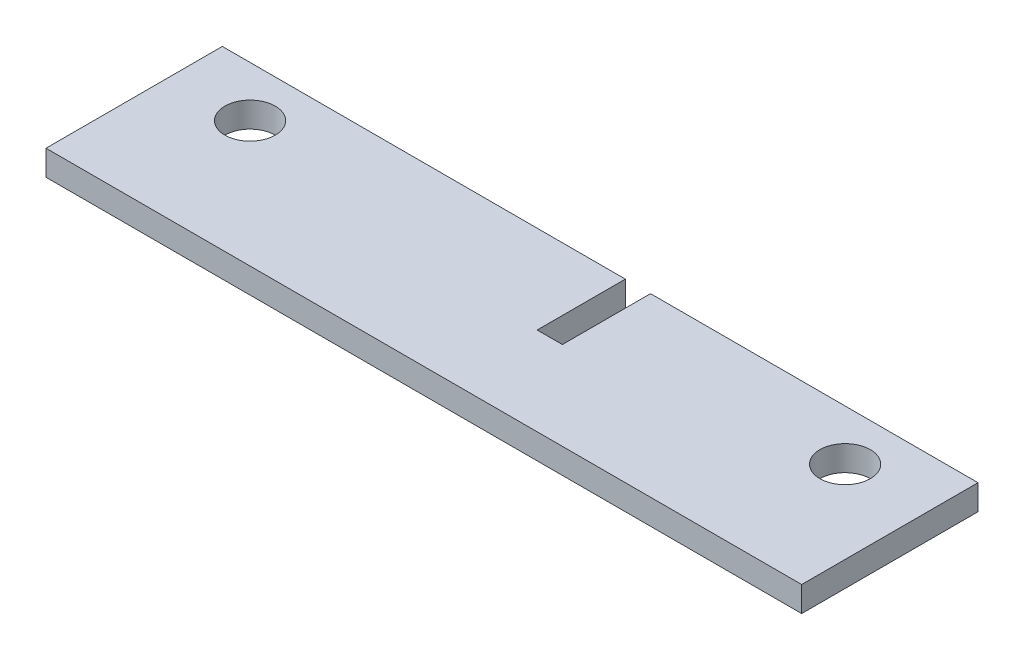
ISO-10303-21;
HEADER;
FILE_DESCRIPTION(('STEP AP214'),'2;1');
FILE_NAME('part.step','',(''),(''),'','','');
FILE_SCHEMA(('AUTOMOTIVE_DESIGN { 1 0 10303 214 1 1 1 1 }'));
ENDSEC;
DATA;
#1=APPLICATION_CONTEXT('core data for automotive mechanical design processes');
#2=APPLICATION_PROTOCOL_DEFINITION('international standard','automotive_design',2000,#1);
#3=PRODUCT_CONTEXT('',#1,'mechanical');
#4=PRODUCT('Part','Part','',(#3));
#5=PRODUCT_RELATED_PRODUCT_CATEGORY('part','',(#4));
#6=PRODUCT_DEFINITION_FORMATION('','',#4);
#7=PRODUCT_DEFINITION_CONTEXT('part definition',#1,'design');
#8=PRODUCT_DEFINITION('design','',#6,#7);
#9=PRODUCT_DEFINITION_SHAPE('','',#8);
#10=(LENGTH_UNIT() NAMED_UNIT(*) SI_UNIT(.MILLI.,.METRE.));
#11=(NAMED_UNIT(*) PLANE_ANGLE_UNIT() SI_UNIT($,.RADIAN.));
#12=(NAMED_UNIT(*) SI_UNIT($,.STERADIAN.) SOLID_ANGLE_UNIT());
#13=UNCERTAINTY_MEASURE_WITH_UNIT(LENGTH_MEASURE(1.E-05),#10,'distance_accuracy_value','');
#14=(GEOMETRIC_REPRESENTATION_CONTEXT(3) GLOBAL_UNCERTAINTY_ASSIGNED_CONTEXT((#13)) GLOBAL_UNIT_ASSIGNED_CONTEXT((#10,
#11,#12)) REPRESENTATION_CONTEXT('',''));
#15=CARTESIAN_POINT('',(0.,0.,0.));
#16=DIRECTION('',(0.,0.,1.));
#17=DIRECTION('',(1.,0.,0.));
#18=AXIS2_PLACEMENT_3D('',#15,#16,#17);
#19=CARTESIAN_POINT('',(0.,0.,249.6));
#20=DIRECTION('',(0.,0.,-1.));
#21=DIRECTION('',(-1.,0.,0.));
#22=AXIS2_PLACEMENT_3D('',#19,#20,#21);
#23=PLANE('',#22);
#24=DIRECTION('',(0.,1.,0.));
#25=VECTOR('',#24,1.);
#26=CARTESIAN_POINT('',(2476.5,115.8,249.6));
#27=LINE('',#26,#25);
#28=CARTESIAN_POINT('',(2476.5,115.8,249.6));
#29=VERTEX_POINT('',#28);
#30=CARTESIAN_POINT('',(2476.5,128.5,249.6));
#31=VERTEX_POINT('',#30);
#32=EDGE_CURVE('E130',#29,#31,#27,.T.);
#33=ORIENTED_EDGE('',*,*,#32,.T.);
#34=DIRECTION('',(-1.,0.,0.));
#35=VECTOR('',#34,1.);
#36=CARTESIAN_POINT('',(2260.6,128.5,249.6));
#37=LINE('',#36,#35);
#38=CARTESIAN_POINT('',(2641.6,128.5,249.6));
#39=VERTEX_POINT('',#38);
#40=EDGE_CURVE('E113',#39,#31,#37,.T.);
#41=ORIENTED_EDGE('',*,*,#40,.F.);
#42=DIRECTION('',(0.,1.,0.));
#43=VECTOR('',#42,1.);
#44=CARTESIAN_POINT('',(2641.6,115.8,249.6));
#45=LINE('',#44,#43);
#46=CARTESIAN_POINT('',(2641.6,115.8,249.6));
#47=VERTEX_POINT('',#46);
#48=EDGE_CURVE('E177',#47,#39,#45,.T.);
#49=ORIENTED_EDGE('',*,*,#48,.F.);
#50=DIRECTION('',(1.,0.,0.));
#51=VECTOR('',#50,1.);
#52=CARTESIAN_POINT('',(2260.6,115.8,249.6));
#53=LINE('',#52,#51);
#54=EDGE_CURVE('E158',#29,#47,#53,.T.);
#55=ORIENTED_EDGE('',*,*,#54,.F.);
#56=EDGE_LOOP('',(#33,#41,#49,#55));
#57=FACE_BOUND('',#56,.T.);
#58=ADVANCED_FACE('F37',(#57),#23,.T.);
#59=CARTESIAN_POINT('',(2260.6,115.8,249.6));
#60=DIRECTION('',(-1.,0.,0.));
#61=DIRECTION('',(0.,0.,1.));
#62=AXIS2_PLACEMENT_3D('',#59,#60,#61);
#63=PLANE('',#62);
#64=DIRECTION('',(0.,0.,1.));
#65=VECTOR('',#64,1.);
#66=CARTESIAN_POINT('',(2260.6,115.8,249.6));
#67=LINE('',#66,#65);
#68=CARTESIAN_POINT('',(2260.6,115.8,249.6));
#69=VERTEX_POINT('',#68);
#70=CARTESIAN_POINT('',(2260.6,115.8,338.5));
#71=VERTEX_POINT('',#70);
#72=EDGE_CURVE('E127',#69,#71,#67,.T.);
#73=ORIENTED_EDGE('',*,*,#72,.T.);
#74=DIRECTION('',(0.,-1.,0.));
#75=VECTOR('',#74,1.);
#76=CARTESIAN_POINT('',(2260.6,115.8,338.5));
#77=LINE('',#76,#75);
#78=CARTESIAN_POINT('',(2260.6,128.5,338.5));
#79=VERTEX_POINT('',#78);
#80=EDGE_CURVE('E120',#79,#71,#77,.T.);
#81=ORIENTED_EDGE('',*,*,#80,.F.);
#82=DIRECTION('',(0.,0.,1.));
#83=VECTOR('',#82,1.);
#84=CARTESIAN_POINT('',(2260.6,128.5,249.6));
#85=LINE('',#84,#83);
#86=CARTESIAN_POINT('',(2260.6,128.5,249.6));
#87=VERTEX_POINT('',#86);
#88=EDGE_CURVE('E107',#87,#79,#85,.T.);
#89=ORIENTED_EDGE('',*,*,#88,.F.);
#90=DIRECTION('',(0.,-1.,0.));
#91=VECTOR('',#90,1.);
#92=CARTESIAN_POINT('',(2260.6,115.8,249.6));
#93=LINE('',#92,#91);
#94=EDGE_CURVE('E118',#87,#69,#93,.T.);
#95=ORIENTED_EDGE('',*,*,#94,.T.);
#96=EDGE_LOOP('',(#73,#81,#89,#95));
#97=FACE_BOUND('',#96,.T.);
#98=ADVANCED_FACE('F117',(#97),#63,.T.);
#99=CARTESIAN_POINT('',(2260.6,128.5,249.6));
#100=DIRECTION('',(0.,1.,0.));
#101=DIRECTION('',(0.,0.,1.));
#102=AXIS2_PLACEMENT_3D('',#99,#100,#101);
#103=PLANE('',#102);
#104=CARTESIAN_POINT('',(2599.99999999996,128.5,275.));
#105=DIRECTION('',(0.,1.,0.));
#106=DIRECTION('',(0.,0.,1.));
#107=AXIS2_PLACEMENT_3D('',#104,#105,#106);
#108=CIRCLE('',#107,12.6999999999999);
#109=CARTESIAN_POINT('',(2599.99999999996,128.5,262.3));
#110=VERTEX_POINT('',#109);
#111=EDGE_CURVE('E126',#110,#110,#108,.F.);
#112=ORIENTED_EDGE('',*,*,#111,.T.);
#113=EDGE_LOOP('',(#112));
#114=FACE_BOUND('',#113,.T.);
#115=CARTESIAN_POINT('',(2299.99999999996,128.5,275.));
#116=DIRECTION('',(0.,1.,0.));
#117=DIRECTION('',(0.,0.,1.));
#118=AXIS2_PLACEMENT_3D('',#115,#116,#117);
#119=CIRCLE('',#118,12.6999999999999);
#120=CARTESIAN_POINT('',(2299.99999999996,128.5,262.3));
#121=VERTEX_POINT('',#120);
#122=EDGE_CURVE('E41',#121,#121,#119,.F.);
#123=ORIENTED_EDGE('',*,*,#122,.T.);
#124=EDGE_LOOP('',(#123));
#125=FACE_BOUND('',#124,.T.);
#126=DIRECTION('',(0.,0.,-1.));
#127=VECTOR('',#126,1.);
#128=CARTESIAN_POINT('',(2476.5,128.5,249.6));
#129=LINE('',#128,#127);
#130=CARTESIAN_POINT('',(2476.5,128.5,294.05));
#131=VERTEX_POINT('',#130);
#132=EDGE_CURVE('E137',#131,#31,#129,.T.);
#133=ORIENTED_EDGE('',*,*,#132,.F.);
#134=DIRECTION('',(1.,0.,0.));
#135=VECTOR('',#134,1.);
#136=CARTESIAN_POINT('',(2476.5,128.5,294.05));
#137=LINE('',#136,#135);
#138=CARTESIAN_POINT('',(2463.8,128.5,294.05));
#139=VERTEX_POINT('',#138);
#140=EDGE_CURVE('E148',#139,#131,#137,.T.);
#141=ORIENTED_EDGE('',*,*,#140,.F.);
#142=DIRECTION('',(0.,0.,1.));
#143=VECTOR('',#142,1.);
#144=CARTESIAN_POINT('',(2463.8,128.5,294.05));
#145=LINE('',#144,#143);
#146=CARTESIAN_POINT('',(2463.8,128.5,249.6));
#147=VERTEX_POINT('',#146);
#148=EDGE_CURVE('E47',#147,#139,#145,.T.);
#149=ORIENTED_EDGE('',*,*,#148,.F.);
#150=EDGE_CURVE('E103',#147,#87,#37,.T.);
#151=ORIENTED_EDGE('',*,*,#150,.T.);
#152=ORIENTED_EDGE('',*,*,#88,.T.);
#153=DIRECTION('',(-1.,0.,0.));
#154=VECTOR('',#153,1.);
#155=CARTESIAN_POINT('',(2260.6,128.5,338.5));
#156=LINE('',#155,#154);
#157=CARTESIAN_POINT('',(2641.6,128.5,338.5));
#158=VERTEX_POINT('',#157);
#159=EDGE_CURVE('E135',#158,#79,#156,.T.);
#160=ORIENTED_EDGE('',*,*,#159,.F.);
#161=DIRECTION('',(0.,0.,1.));
#162=VECTOR('',#161,1.);
#163=CARTESIAN_POINT('',(2641.6,128.5,249.6));
#164=LINE('',#163,#162);
#165=EDGE_CURVE('E181',#39,#158,#164,.T.);
#166=ORIENTED_EDGE('',*,*,#165,.F.);
#167=ORIENTED_EDGE('',*,*,#40,.T.);
#168=EDGE_LOOP('',(#133,#141,#149,#151,#152,#160,#166,#167));
#169=FACE_BOUND('',#168,.T.);
#170=ADVANCED_FACE('F39',(#114,#125,#169),#103,.T.);
#171=CARTESIAN_POINT('',(2641.6,115.8,249.6));
#172=DIRECTION('',(1.,0.,0.));
#173=DIRECTION('',(0.,0.,-1.));
#174=AXIS2_PLACEMENT_3D('',#171,#172,#173);
#175=PLANE('',#174);
#176=ORIENTED_EDGE('',*,*,#165,.T.);
#177=DIRECTION('',(0.,1.,0.));
#178=VECTOR('',#177,1.);
#179=CARTESIAN_POINT('',(2641.6,115.8,338.5));
#180=LINE('',#179,#178);
#181=CARTESIAN_POINT('',(2641.6,115.8,338.5));
#182=VERTEX_POINT('',#181);
#183=EDGE_CURVE('E138',#182,#158,#180,.T.);
#184=ORIENTED_EDGE('',*,*,#183,.F.);
#185=DIRECTION('',(0.,0.,1.));
#186=VECTOR('',#185,1.);
#187=CARTESIAN_POINT('',(2641.6,115.8,249.6));
#188=LINE('',#187,#186);
#189=EDGE_CURVE('E165',#47,#182,#188,.T.);
#190=ORIENTED_EDGE('',*,*,#189,.F.);
#191=ORIENTED_EDGE('',*,*,#48,.T.);
#192=EDGE_LOOP('',(#176,#184,#190,#191));
#193=FACE_BOUND('',#192,.T.);
#194=ADVANCED_FACE('F176',(#193),#175,.T.);
#195=CARTESIAN_POINT('',(2260.6,115.8,249.6));
#196=DIRECTION('',(0.,-1.,0.));
#197=DIRECTION('',(0.,0.,-1.));
#198=AXIS2_PLACEMENT_3D('',#195,#196,#197);
#199=PLANE('',#198);
#200=CARTESIAN_POINT('',(2599.99999999996,115.8,275.));
#201=DIRECTION('',(0.,-1.,0.));
#202=DIRECTION('',(0.,0.,-1.));
#203=AXIS2_PLACEMENT_3D('',#200,#201,#202);
#204=CIRCLE('',#203,12.6999999999999);
#205=CARTESIAN_POINT('',(2599.99999999996,115.8,262.3));
#206=VERTEX_POINT('',#205);
#207=EDGE_CURVE('E180',#206,#206,#204,.F.);
#208=ORIENTED_EDGE('',*,*,#207,.T.);
#209=EDGE_LOOP('',(#208));
#210=FACE_BOUND('',#209,.T.);
#211=CARTESIAN_POINT('',(2299.99999999996,115.8,275.));
#212=DIRECTION('',(0.,-1.,0.));
#213=DIRECTION('',(0.,0.,-1.));
#214=AXIS2_PLACEMENT_3D('',#211,#212,#213);
#215=CIRCLE('',#214,12.6999999999999);
#216=CARTESIAN_POINT('',(2299.99999999996,115.8,262.3));
#217=VERTEX_POINT('',#216);
#218=EDGE_CURVE('E159',#217,#217,#215,.F.);
#219=ORIENTED_EDGE('',*,*,#218,.T.);
#220=EDGE_LOOP('',(#219));
#221=FACE_BOUND('',#220,.T.);
#222=DIRECTION('',(0.,0.,-1.));
#223=VECTOR('',#222,1.);
#224=CARTESIAN_POINT('',(2476.5,115.8,249.6));
#225=LINE('',#224,#223);
#226=CARTESIAN_POINT('',(2476.5,115.8,294.05));
#227=VERTEX_POINT('',#226);
#228=EDGE_CURVE('E155',#227,#29,#225,.T.);
#229=ORIENTED_EDGE('',*,*,#228,.T.);
#230=ORIENTED_EDGE('',*,*,#54,.T.);
#231=ORIENTED_EDGE('',*,*,#189,.T.);
#232=DIRECTION('',(1.,0.,0.));
#233=VECTOR('',#232,1.);
#234=CARTESIAN_POINT('',(2260.6,115.8,338.5));
#235=LINE('',#234,#233);
#236=EDGE_CURVE('E141',#71,#182,#235,.T.);
#237=ORIENTED_EDGE('',*,*,#236,.F.);
#238=ORIENTED_EDGE('',*,*,#72,.F.);
#239=CARTESIAN_POINT('',(2463.8,115.8,249.6));
#240=VERTEX_POINT('',#239);
#241=EDGE_CURVE('E125',#69,#240,#53,.T.);
#242=ORIENTED_EDGE('',*,*,#241,.T.);
#243=DIRECTION('',(0.,0.,1.));
#244=VECTOR('',#243,1.);
#245=CARTESIAN_POINT('',(2463.8,115.8,294.05));
#246=LINE('',#245,#244);
#247=CARTESIAN_POINT('',(2463.8,115.8,294.05));
#248=VERTEX_POINT('',#247);
#249=EDGE_CURVE('E162',#240,#248,#246,.T.);
#250=ORIENTED_EDGE('',*,*,#249,.T.);
#251=DIRECTION('',(1.,0.,0.));
#252=VECTOR('',#251,1.);
#253=CARTESIAN_POINT('',(2476.5,115.8,294.05));
#254=LINE('',#253,#252);
#255=EDGE_CURVE('E144',#248,#227,#254,.T.);
#256=ORIENTED_EDGE('',*,*,#255,.T.);
#257=EDGE_LOOP('',(#229,#230,#231,#237,#238,#242,#250,#256));
#258=FACE_BOUND('',#257,.T.);
#259=ADVANCED_FACE('F169',(#210,#221,#258),#199,.T.);
#260=DIRECTION('',(0.,1.,0.));
#261=VECTOR('',#260,1.);
#262=CARTESIAN_POINT('',(2463.8,115.8,249.6));
#263=LINE('',#262,#261);
#264=EDGE_CURVE('E11',#240,#147,#263,.T.);
#265=ORIENTED_EDGE('',*,*,#264,.F.);
#266=ORIENTED_EDGE('',*,*,#241,.F.);
#267=ORIENTED_EDGE('',*,*,#94,.F.);
#268=ORIENTED_EDGE('',*,*,#150,.F.);
#269=EDGE_LOOP('',(#265,#266,#267,#268));
#270=FACE_BOUND('',#269,.T.);
#271=ADVANCED_FACE('F123',(#270),#23,.T.);
#272=CARTESIAN_POINT('',(0.,0.,338.5));
#273=DIRECTION('',(0.,0.,-1.));
#274=DIRECTION('',(-1.,0.,0.));
#275=AXIS2_PLACEMENT_3D('',#272,#273,#274);
#276=PLANE('',#275);
#277=ORIENTED_EDGE('',*,*,#80,.T.);
#278=ORIENTED_EDGE('',*,*,#236,.T.);
#279=ORIENTED_EDGE('',*,*,#183,.T.);
#280=ORIENTED_EDGE('',*,*,#159,.T.);
#281=EDGE_LOOP('',(#277,#278,#279,#280));
#282=FACE_BOUND('',#281,.T.);
#283=ADVANCED_FACE('F214',(#282),#276,.F.);
#284=CARTESIAN_POINT('',(2476.5,115.8,249.6));
#285=DIRECTION('',(1.,0.,0.));
#286=DIRECTION('',(0.,0.,-1.));
#287=AXIS2_PLACEMENT_3D('',#284,#285,#286);
#288=PLANE('',#287);
#289=ORIENTED_EDGE('',*,*,#132,.T.);
#290=ORIENTED_EDGE('',*,*,#32,.F.);
#291=ORIENTED_EDGE('',*,*,#228,.F.);
#292=DIRECTION('',(0.,1.,0.));
#293=VECTOR('',#292,1.);
#294=CARTESIAN_POINT('',(2476.5,115.8,294.05));
#295=LINE('',#294,#293);
#296=EDGE_CURVE('E71',#227,#131,#295,.T.);
#297=ORIENTED_EDGE('',*,*,#296,.T.);
#298=EDGE_LOOP('',(#289,#290,#291,#297));
#299=FACE_BOUND('',#298,.T.);
#300=ADVANCED_FACE('F219',(#299),#288,.F.);
#301=CARTESIAN_POINT('',(2476.5,115.8,294.05));
#302=DIRECTION('',(0.,0.,1.));
#303=DIRECTION('',(1.,0.,0.));
#304=AXIS2_PLACEMENT_3D('',#301,#302,#303);
#305=PLANE('',#304);
#306=ORIENTED_EDGE('',*,*,#140,.T.);
#307=ORIENTED_EDGE('',*,*,#296,.F.);
#308=ORIENTED_EDGE('',*,*,#255,.F.);
#309=DIRECTION('',(0.,1.,0.));
#310=VECTOR('',#309,1.);
#311=CARTESIAN_POINT('',(2463.8,115.8,294.05));
#312=LINE('',#311,#310);
#313=EDGE_CURVE('E146',#248,#139,#312,.T.);
#314=ORIENTED_EDGE('',*,*,#313,.T.);
#315=EDGE_LOOP('',(#306,#307,#308,#314));
#316=FACE_BOUND('',#315,.T.);
#317=ADVANCED_FACE('F202',(#316),#305,.F.);
#318=CARTESIAN_POINT('',(2463.8,115.8,294.05));
#319=DIRECTION('',(-1.,0.,0.));
#320=DIRECTION('',(0.,0.,1.));
#321=AXIS2_PLACEMENT_3D('',#318,#319,#320);
#322=PLANE('',#321);
#323=ORIENTED_EDGE('',*,*,#148,.T.);
#324=ORIENTED_EDGE('',*,*,#313,.F.);
#325=ORIENTED_EDGE('',*,*,#249,.F.);
#326=ORIENTED_EDGE('',*,*,#264,.T.);
#327=EDGE_LOOP('',(#323,#324,#325,#326));
#328=FACE_BOUND('',#327,.T.);
#329=ADVANCED_FACE('F193',(#328),#322,.F.);
#330=CARTESIAN_POINT('',(2299.99999999996,181.249999999996,275.));
#331=DIRECTION('',(0.,-1.,0.));
#332=DIRECTION('',(0.,0.,-1.));
#333=AXIS2_PLACEMENT_3D('',#330,#331,#332);
#334=CYLINDRICAL_SURFACE('',#333,12.6999999999999);
#335=CARTESIAN_POINT('',(2299.99999999996,128.5,262.3));
#336=CARTESIAN_POINT('',(2299.99999999996,128.367708333333,262.3));
#337=CARTESIAN_POINT('',(2299.99999999996,128.235416666667,262.3));
#338=CARTESIAN_POINT('',(2299.99999999996,127.970833333333,262.3));
#339=CARTESIAN_POINT('',(2299.99999999996,127.838541666667,262.3));
#340=CARTESIAN_POINT('',(2299.99999999996,127.573958333333,262.3));
#341=CARTESIAN_POINT('',(2299.99999999996,127.441666666667,262.3));
#342=CARTESIAN_POINT('',(2299.99999999996,127.177083333333,262.3));
#343=CARTESIAN_POINT('',(2299.99999999996,127.044791666667,262.3));
#344=CARTESIAN_POINT('',(2299.99999999996,126.780208333333,262.3));
#345=CARTESIAN_POINT('',(2299.99999999996,126.647916666667,262.3));
#346=CARTESIAN_POINT('',(2299.99999999996,126.383333333333,262.3));
#347=CARTESIAN_POINT('',(2299.99999999996,126.251041666667,262.3));
#348=CARTESIAN_POINT('',(2299.99999999996,125.986458333333,262.3));
#349=CARTESIAN_POINT('',(2299.99999999996,125.854166666667,262.3));
#350=CARTESIAN_POINT('',(2299.99999999996,125.589583333333,262.3));
#351=CARTESIAN_POINT('',(2299.99999999996,125.457291666667,262.3));
#352=CARTESIAN_POINT('',(2299.99999999996,125.192708333333,262.3));
#353=CARTESIAN_POINT('',(2299.99999999996,125.060416666667,262.3));
#354=CARTESIAN_POINT('',(2299.99999999996,124.795833333333,262.3));
#355=CARTESIAN_POINT('',(2299.99999999996,124.663541666667,262.3));
#356=CARTESIAN_POINT('',(2299.99999999996,124.398958333333,262.3));
#357=CARTESIAN_POINT('',(2299.99999999996,124.266666666667,262.3));
#358=CARTESIAN_POINT('',(2299.99999999996,124.002083333333,262.3));
#359=CARTESIAN_POINT('',(2299.99999999996,123.869791666667,262.3));
#360=CARTESIAN_POINT('',(2299.99999999996,123.605208333333,262.3));
#361=CARTESIAN_POINT('',(2299.99999999996,123.472916666667,262.3));
#362=CARTESIAN_POINT('',(2299.99999999996,123.208333333333,262.3));
#363=CARTESIAN_POINT('',(2299.99999999996,123.076041666667,262.3));
#364=CARTESIAN_POINT('',(2299.99999999996,122.811458333333,262.3));
#365=CARTESIAN_POINT('',(2299.99999999996,122.679166666667,262.3));
#366=CARTESIAN_POINT('',(2299.99999999996,122.414583333333,262.3));
#367=CARTESIAN_POINT('',(2299.99999999996,122.282291666667,262.3));
#368=CARTESIAN_POINT('',(2299.99999999996,122.017708333333,262.3));
#369=CARTESIAN_POINT('',(2299.99999999996,121.885416666667,262.3));
#370=CARTESIAN_POINT('',(2299.99999999996,121.620833333333,262.3));
#371=CARTESIAN_POINT('',(2299.99999999996,121.488541666667,262.3));
#372=CARTESIAN_POINT('',(2299.99999999996,121.223958333333,262.3));
#373=CARTESIAN_POINT('',(2299.99999999996,121.091666666667,262.3));
#374=CARTESIAN_POINT('',(2299.99999999996,120.827083333333,262.3));
#375=CARTESIAN_POINT('',(2299.99999999996,120.694791666667,262.3));
#376=CARTESIAN_POINT('',(2299.99999999996,120.430208333333,262.3));
#377=CARTESIAN_POINT('',(2299.99999999996,120.297916666667,262.3));
#378=CARTESIAN_POINT('',(2299.99999999996,120.033333333333,262.3));
#379=CARTESIAN_POINT('',(2299.99999999996,119.901041666667,262.3));
#380=CARTESIAN_POINT('',(2299.99999999996,119.636458333333,262.3));
#381=CARTESIAN_POINT('',(2299.99999999996,119.504166666667,262.3));
#382=CARTESIAN_POINT('',(2299.99999999996,119.239583333333,262.3));
#383=CARTESIAN_POINT('',(2299.99999999996,119.107291666667,262.3));
#384=CARTESIAN_POINT('',(2299.99999999996,118.842708333333,262.3));
#385=CARTESIAN_POINT('',(2299.99999999996,118.710416666667,262.3));
#386=CARTESIAN_POINT('',(2299.99999999996,118.445833333333,262.3));
#387=CARTESIAN_POINT('',(2299.99999999996,118.313541666667,262.3));
#388=CARTESIAN_POINT('',(2299.99999999996,118.048958333333,262.3));
#389=CARTESIAN_POINT('',(2299.99999999996,117.916666666667,262.3));
#390=CARTESIAN_POINT('',(2299.99999999996,117.652083333333,262.3));
#391=CARTESIAN_POINT('',(2299.99999999996,117.519791666667,262.3));
#392=CARTESIAN_POINT('',(2299.99999999996,117.255208333333,262.3));
#393=CARTESIAN_POINT('',(2299.99999999996,117.122916666667,262.3));
#394=CARTESIAN_POINT('',(2299.99999999996,116.858333333333,262.3));
#395=CARTESIAN_POINT('',(2299.99999999996,116.726041666667,262.3));
#396=CARTESIAN_POINT('',(2299.99999999996,116.461458333333,262.3));
#397=CARTESIAN_POINT('',(2299.99999999996,116.329166666667,262.3));
#398=CARTESIAN_POINT('',(2299.99999999996,116.064583333333,262.3));
#399=CARTESIAN_POINT('',(2299.99999999996,115.932291666667,262.3));
#400=CARTESIAN_POINT('',(2299.99999999996,115.8,262.3));
#401=B_SPLINE_CURVE_WITH_KNOTS('',3,(#335,#336,#337,#338,#339,#340,#341,#342,#343,#344,#345,
#346,#347,#348,#349,#350,#351,#352,#353,#354,#355,#356,#357,#358,#359,#360,#361,#362,#363,#364,
#365,#366,#367,#368,#369,#370,#371,#372,#373,#374,#375,#376,#377,#378,#379,#380,#381,#382,#383,
#384,#385,#386,#387,#388,#389,#390,#391,#392,#393,#394,#395,#396,#397,#398,#399,#400),
.UNSPECIFIED.,.F.,.F.,(4,2,2,2,2,2,2,2,2,2,2,2,2,2,2,2,2,2,2,2,2,2,2,2,2,2,2,2,2,2,2,2,4),(0.,
0.396874999999991,0.793749999999982,1.190625,1.58749999999999,1.98437499999998,2.38124999999997,
2.77812499999996,3.17499999999998,3.57187499999997,3.96874999999998,4.36562499999998,
4.76249999999998,5.15937499999998,5.55624999999998,5.95312499999998,6.34999999999997,
6.74687499999997,7.14374999999998,7.54062499999997,7.93749999999997,8.33437499999998,
8.73124999999997,9.12812499999996,9.52499999999996,9.92187499999997,10.31875,10.715625,11.1125,
11.509375,11.90625,12.303125,12.7),.UNSPECIFIED.);
#402=EDGE_CURVE('BSEAM190',#121,#217,#401,.T.);
#403=ORIENTED_EDGE('',*,*,#122,.F.);
#404=ORIENTED_EDGE('',*,*,#218,.F.);
#405=ORIENTED_EDGE('',*,*,#402,.T.);
#406=ORIENTED_EDGE('',*,*,#402,.F.);
#407=EDGE_LOOP('',(#403,#405,#404,#406));
#408=FACE_BOUND('',#407,.T.);
#409=ADVANCED_FACE('F190',(#408),#334,.F.);
#410=CARTESIAN_POINT('',(2599.99999999996,289.999999999996,275.));
#411=DIRECTION('',(0.,-1.,0.));
#412=DIRECTION('',(0.,0.,-1.));
#413=AXIS2_PLACEMENT_3D('',#410,#411,#412);
#414=CYLINDRICAL_SURFACE('',#413,12.6999999999999);
#415=CARTESIAN_POINT('',(2599.99999999996,128.5,262.3));
#416=CARTESIAN_POINT('',(2599.99999999996,128.367708333333,262.3));
#417=CARTESIAN_POINT('',(2599.99999999996,128.235416666667,262.3));
#418=CARTESIAN_POINT('',(2599.99999999996,127.970833333333,262.3));
#419=CARTESIAN_POINT('',(2599.99999999996,127.838541666667,262.3));
#420=CARTESIAN_POINT('',(2599.99999999996,127.573958333333,262.3));
#421=CARTESIAN_POINT('',(2599.99999999996,127.441666666667,262.3));
#422=CARTESIAN_POINT('',(2599.99999999996,127.177083333333,262.3));
#423=CARTESIAN_POINT('',(2599.99999999996,127.044791666667,262.3));
#424=CARTESIAN_POINT('',(2599.99999999996,126.780208333333,262.3));
#425=CARTESIAN_POINT('',(2599.99999999996,126.647916666667,262.3));
#426=CARTESIAN_POINT('',(2599.99999999996,126.383333333333,262.3));
#427=CARTESIAN_POINT('',(2599.99999999996,126.251041666667,262.3));
#428=CARTESIAN_POINT('',(2599.99999999996,125.986458333333,262.3));
#429=CARTESIAN_POINT('',(2599.99999999996,125.854166666667,262.3));
#430=CARTESIAN_POINT('',(2599.99999999996,125.589583333333,262.3));
#431=CARTESIAN_POINT('',(2599.99999999996,125.457291666667,262.3));
#432=CARTESIAN_POINT('',(2599.99999999996,125.192708333333,262.3));
#433=CARTESIAN_POINT('',(2599.99999999996,125.060416666667,262.3));
#434=CARTESIAN_POINT('',(2599.99999999996,124.795833333333,262.3));
#435=CARTESIAN_POINT('',(2599.99999999996,124.663541666667,262.3));
#436=CARTESIAN_POINT('',(2599.99999999996,124.398958333333,262.3));
#437=CARTESIAN_POINT('',(2599.99999999996,124.266666666667,262.3));
#438=CARTESIAN_POINT('',(2599.99999999996,124.002083333333,262.3));
#439=CARTESIAN_POINT('',(2599.99999999996,123.869791666667,262.3));
#440=CARTESIAN_POINT('',(2599.99999999996,123.605208333333,262.3));
#441=CARTESIAN_POINT('',(2599.99999999996,123.472916666667,262.3));
#442=CARTESIAN_POINT('',(2599.99999999996,123.208333333333,262.3));
#443=CARTESIAN_POINT('',(2599.99999999996,123.076041666667,262.3));
#444=CARTESIAN_POINT('',(2599.99999999996,122.811458333333,262.3));
#445=CARTESIAN_POINT('',(2599.99999999996,122.679166666667,262.3));
#446=CARTESIAN_POINT('',(2599.99999999996,122.414583333333,262.3));
#447=CARTESIAN_POINT('',(2599.99999999996,122.282291666667,262.3));
#448=CARTESIAN_POINT('',(2599.99999999996,122.017708333333,262.3));
#449=CARTESIAN_POINT('',(2599.99999999996,121.885416666667,262.3));
#450=CARTESIAN_POINT('',(2599.99999999996,121.620833333333,262.3));
#451=CARTESIAN_POINT('',(2599.99999999996,121.488541666667,262.3));
#452=CARTESIAN_POINT('',(2599.99999999996,121.223958333333,262.3));
#453=CARTESIAN_POINT('',(2599.99999999996,121.091666666667,262.3));
#454=CARTESIAN_POINT('',(2599.99999999996,120.827083333333,262.3));
#455=CARTESIAN_POINT('',(2599.99999999996,120.694791666667,262.3));
#456=CARTESIAN_POINT('',(2599.99999999996,120.430208333333,262.3));
#457=CARTESIAN_POINT('',(2599.99999999996,120.297916666667,262.3));
#458=CARTESIAN_POINT('',(2599.99999999996,120.033333333333,262.3));
#459=CARTESIAN_POINT('',(2599.99999999996,119.901041666667,262.3));
#460=CARTESIAN_POINT('',(2599.99999999996,119.636458333333,262.3));
#461=CARTESIAN_POINT('',(2599.99999999996,119.504166666667,262.3));
#462=CARTESIAN_POINT('',(2599.99999999996,119.239583333333,262.3));
#463=CARTESIAN_POINT('',(2599.99999999996,119.107291666667,262.3));
#464=CARTESIAN_POINT('',(2599.99999999996,118.842708333333,262.3));
#465=CARTESIAN_POINT('',(2599.99999999996,118.710416666667,262.3));
#466=CARTESIAN_POINT('',(2599.99999999996,118.445833333333,262.3));
#467=CARTESIAN_POINT('',(2599.99999999996,118.313541666667,262.3));
#468=CARTESIAN_POINT('',(2599.99999999996,118.048958333333,262.3));
#469=CARTESIAN_POINT('',(2599.99999999996,117.916666666667,262.3));
#470=CARTESIAN_POINT('',(2599.99999999996,117.652083333333,262.3));
#471=CARTESIAN_POINT('',(2599.99999999996,117.519791666667,262.3));
#472=CARTESIAN_POINT('',(2599.99999999996,117.255208333333,262.3));
#473=CARTESIAN_POINT('',(2599.99999999996,117.122916666667,262.3));
#474=CARTESIAN_POINT('',(2599.99999999996,116.858333333333,262.3));
#475=CARTESIAN_POINT('',(2599.99999999996,116.726041666667,262.3));
#476=CARTESIAN_POINT('',(2599.99999999996,116.461458333333,262.3));
#477=CARTESIAN_POINT('',(2599.99999999996,116.329166666667,262.3));
#478=CARTESIAN_POINT('',(2599.99999999996,116.064583333333,262.3));
#479=CARTESIAN_POINT('',(2599.99999999996,115.932291666667,262.3));
#480=CARTESIAN_POINT('',(2599.99999999996,115.8,262.3));
#481=B_SPLINE_CURVE_WITH_KNOTS('',3,(#415,#416,#417,#418,#419,#420,#421,#422,#423,#424,#425,
#426,#427,#428,#429,#430,#431,#432,#433,#434,#435,#436,#437,#438,#439,#440,#441,#442,#443,#444,
#445,#446,#447,#448,#449,#450,#451,#452,#453,#454,#455,#456,#457,#458,#459,#460,#461,#462,#463,
#464,#465,#466,#467,#468,#469,#470,#471,#472,#473,#474,#475,#476,#477,#478,#479,#480),
.UNSPECIFIED.,.F.,.F.,(4,2,2,2,2,2,2,2,2,2,2,2,2,2,2,2,2,2,2,2,2,2,2,2,2,2,2,2,2,2,2,2,4),(0.,
0.396874999999991,0.79375000000001,1.190625,1.58749999999999,1.98437500000001,2.38125,
2.77812499999999,3.17499999999998,3.571875,3.96874999999999,4.36562499999998,4.7625,
5.15937499999999,5.55624999999998,5.953125,6.34999999999999,6.74687499999999,7.14375,7.540625,
7.93749999999999,8.334375,8.73125,9.12812499999999,9.52500000000001,9.921875,10.31875,10.715625,
11.1125,11.509375,11.90625,12.303125,12.7),.UNSPECIFIED.);
#482=EDGE_CURVE('BSEAM192',#110,#206,#481,.T.);
#483=ORIENTED_EDGE('',*,*,#111,.F.);
#484=ORIENTED_EDGE('',*,*,#207,.F.);
#485=ORIENTED_EDGE('',*,*,#482,.T.);
#486=ORIENTED_EDGE('',*,*,#482,.F.);
#487=EDGE_LOOP('',(#483,#485,#484,#486));
#488=FACE_BOUND('',#487,.T.);
#489=ADVANCED_FACE('F192',(#488),#414,.F.);
#490=CLOSED_SHELL('',(#58,#98,#170,#194,#259,#271,#283,#300,#317,#329,#409,#489));
#491=MANIFOLD_SOLID_BREP('B2',#490);
#492=ADVANCED_BREP_SHAPE_REPRESENTATION('',(#18,#491),#14);
#493=SHAPE_DEFINITION_REPRESENTATION(#9,#492);
ENDSEC;
END-ISO-10303-21;
